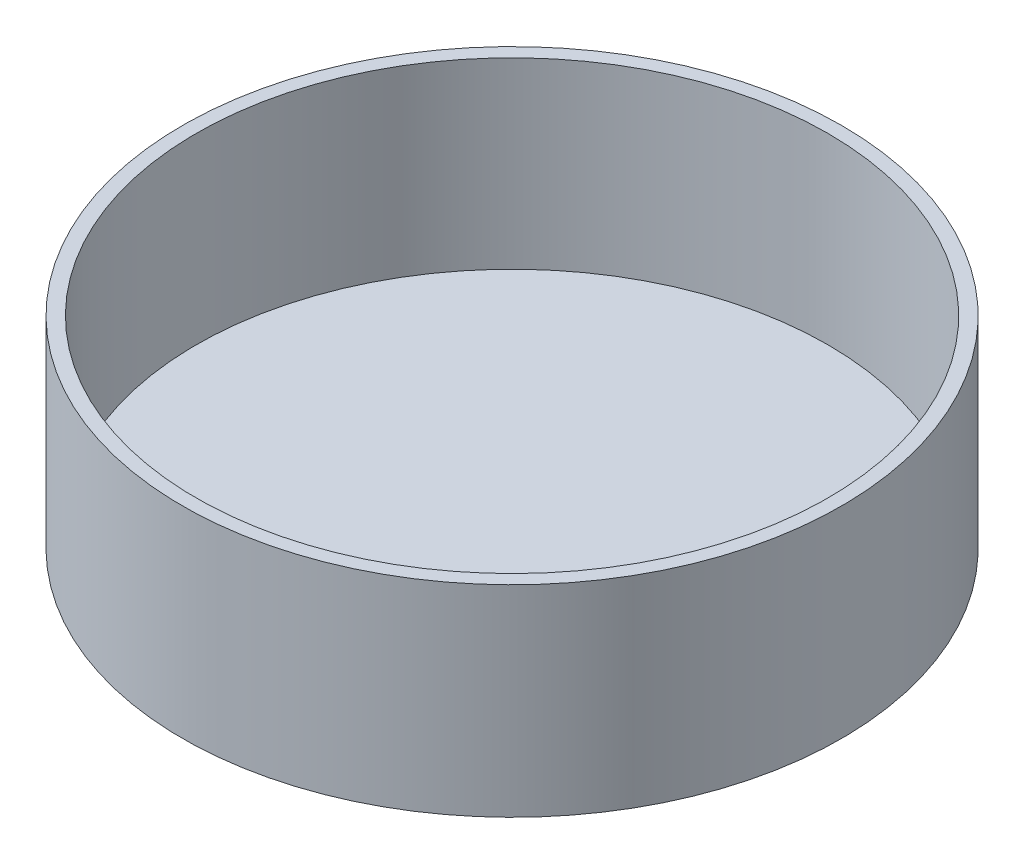
ISO-10303-21;
HEADER;
FILE_DESCRIPTION(('STEP AP214'),'2;1');
FILE_NAME('part.step','',(''),(''),'','','');
FILE_SCHEMA(('AUTOMOTIVE_DESIGN { 1 0 10303 214 1 1 1 1 }'));
ENDSEC;
DATA;
#1=APPLICATION_CONTEXT('core data for automotive mechanical design processes');
#2=APPLICATION_PROTOCOL_DEFINITION('international standard','automotive_design',2000,#1);
#3=PRODUCT_CONTEXT('',#1,'mechanical');
#4=PRODUCT('Part','Part','',(#3));
#5=PRODUCT_RELATED_PRODUCT_CATEGORY('part','',(#4));
#6=PRODUCT_DEFINITION_FORMATION('','',#4);
#7=PRODUCT_DEFINITION_CONTEXT('part definition',#1,'design');
#8=PRODUCT_DEFINITION('design','',#6,#7);
#9=PRODUCT_DEFINITION_SHAPE('','',#8);
#10=(LENGTH_UNIT() NAMED_UNIT(*) SI_UNIT(.MILLI.,.METRE.));
#11=(NAMED_UNIT(*) PLANE_ANGLE_UNIT() SI_UNIT($,.RADIAN.));
#12=(NAMED_UNIT(*) SI_UNIT($,.STERADIAN.) SOLID_ANGLE_UNIT());
#13=UNCERTAINTY_MEASURE_WITH_UNIT(LENGTH_MEASURE(1.E-05),#10,'distance_accuracy_value','');
#14=(GEOMETRIC_REPRESENTATION_CONTEXT(3) GLOBAL_UNCERTAINTY_ASSIGNED_CONTEXT((#13)) GLOBAL_UNIT_ASSIGNED_CONTEXT((#10,
#11,#12)) REPRESENTATION_CONTEXT('',''));
#15=CARTESIAN_POINT('',(0.,0.,0.));
#16=DIRECTION('',(0.,0.,1.));
#17=DIRECTION('',(1.,0.,0.));
#18=AXIS2_PLACEMENT_3D('',#15,#16,#17);
#19=CARTESIAN_POINT('',(0.,0.,0.));
#20=DIRECTION('',(0.,1.,0.));
#21=DIRECTION('',(0.,0.,1.));
#22=AXIS2_PLACEMENT_3D('',#19,#20,#21);
#23=PLANE('',#22);
#24=CARTESIAN_POINT('',(0.,0.,0.));
#25=DIRECTION('',(0.,-1.,0.));
#26=DIRECTION('',(0.,0.,-1.));
#27=AXIS2_PLACEMENT_3D('',#24,#25,#26);
#28=CIRCLE('',#27,114.3);
#29=CARTESIAN_POINT('',(0.,0.,-114.3));
#30=VERTEX_POINT('',#29);
#31=EDGE_CURVE('E10',#30,#30,#28,.T.);
#32=ORIENTED_EDGE('',*,*,#31,.T.);
#33=EDGE_LOOP('',(#32));
#34=FACE_BOUND('',#33,.T.);
#35=ADVANCED_FACE('F38',(#34),#23,.F.);
#36=CARTESIAN_POINT('',(0.,-45.633687212475,0.));
#37=DIRECTION('',(0.,-1.,0.));
#38=DIRECTION('',(0.,0.,-1.));
#39=AXIS2_PLACEMENT_3D('',#36,#37,#38);
#40=CYLINDRICAL_SURFACE('',#39,114.3);
#41=ORIENTED_EDGE('',*,*,#31,.F.);
#42=EDGE_LOOP('',(#41));
#43=FACE_BOUND('',#42,.T.);
#44=CARTESIAN_POINT('',(0.,69.85,0.));
#45=DIRECTION('',(0.,-1.,0.));
#46=DIRECTION('',(0.,0.,-1.));
#47=AXIS2_PLACEMENT_3D('',#44,#45,#46);
#48=CIRCLE('',#47,114.3);
#49=CARTESIAN_POINT('',(0.,69.85,-114.3));
#50=VERTEX_POINT('',#49);
#51=EDGE_CURVE('E45',#50,#50,#48,.T.);
#52=ORIENTED_EDGE('',*,*,#51,.T.);
#53=EDGE_LOOP('',(#52));
#54=FACE_BOUND('',#53,.T.);
#55=ADVANCED_FACE('F77',(#43,#54),#40,.T.);
#56=CARTESIAN_POINT('',(0.,69.85,114.3));
#57=DIRECTION('',(0.,-1.,0.));
#58=DIRECTION('',(0.,0.,-1.));
#59=AXIS2_PLACEMENT_3D('',#56,#57,#58);
#60=PLANE('',#59);
#61=ORIENTED_EDGE('',*,*,#51,.F.);
#62=EDGE_LOOP('',(#61));
#63=FACE_BOUND('',#62,.T.);
#64=CARTESIAN_POINT('',(0.,69.85,0.));
#65=DIRECTION('',(0.,-1.,0.));
#66=DIRECTION('',(0.,0.,-1.));
#67=AXIS2_PLACEMENT_3D('',#64,#65,#66);
#68=CIRCLE('',#67,109.5375);
#69=CARTESIAN_POINT('',(0.,69.85,-109.5375));
#70=VERTEX_POINT('',#69);
#71=EDGE_CURVE('E51',#70,#70,#68,.T.);
#72=ORIENTED_EDGE('',*,*,#71,.T.);
#73=EDGE_LOOP('',(#72));
#74=FACE_BOUND('',#73,.T.);
#75=ADVANCED_FACE('F73',(#63,#74),#60,.F.);
#76=CARTESIAN_POINT('',(0.,-45.633687212475,0.));
#77=DIRECTION('',(0.,-1.,0.));
#78=DIRECTION('',(0.,0.,-1.));
#79=AXIS2_PLACEMENT_3D('',#76,#77,#78);
#80=CYLINDRICAL_SURFACE('',#79,109.5375);
#81=ORIENTED_EDGE('',*,*,#71,.F.);
#82=EDGE_LOOP('',(#81));
#83=FACE_BOUND('',#82,.T.);
#84=CARTESIAN_POINT('',(0.,6.34999999999999,0.));
#85=DIRECTION('',(0.,-1.,0.));
#86=DIRECTION('',(0.,0.,-1.));
#87=AXIS2_PLACEMENT_3D('',#84,#85,#86);
#88=CIRCLE('',#87,109.5375);
#89=CARTESIAN_POINT('',(0.,6.34999999999999,-109.5375));
#90=VERTEX_POINT('',#89);
#91=EDGE_CURVE('E57',#90,#90,#88,.T.);
#92=ORIENTED_EDGE('',*,*,#91,.T.);
#93=EDGE_LOOP('',(#92));
#94=FACE_BOUND('',#93,.T.);
#95=ADVANCED_FACE('F65',(#83,#94),#80,.F.);
#96=CARTESIAN_POINT('',(0.,6.34999999999999,109.5375));
#97=DIRECTION('',(0.,-1.,0.));
#98=DIRECTION('',(0.,0.,-1.));
#99=AXIS2_PLACEMENT_3D('',#96,#97,#98);
#100=PLANE('',#99);
#101=ORIENTED_EDGE('',*,*,#91,.F.);
#102=EDGE_LOOP('',(#101));
#103=FACE_BOUND('',#102,.T.);
#104=ADVANCED_FACE('F67',(#103),#100,.F.);
#105=CLOSED_SHELL('',(#35,#55,#75,#95,#104));
#106=MANIFOLD_SOLID_BREP('B2',#105);
#107=ADVANCED_BREP_SHAPE_REPRESENTATION('',(#18,#106),#14);
#108=SHAPE_DEFINITION_REPRESENTATION(#9,#107);
ENDSEC;
END-ISO-10303-21;
